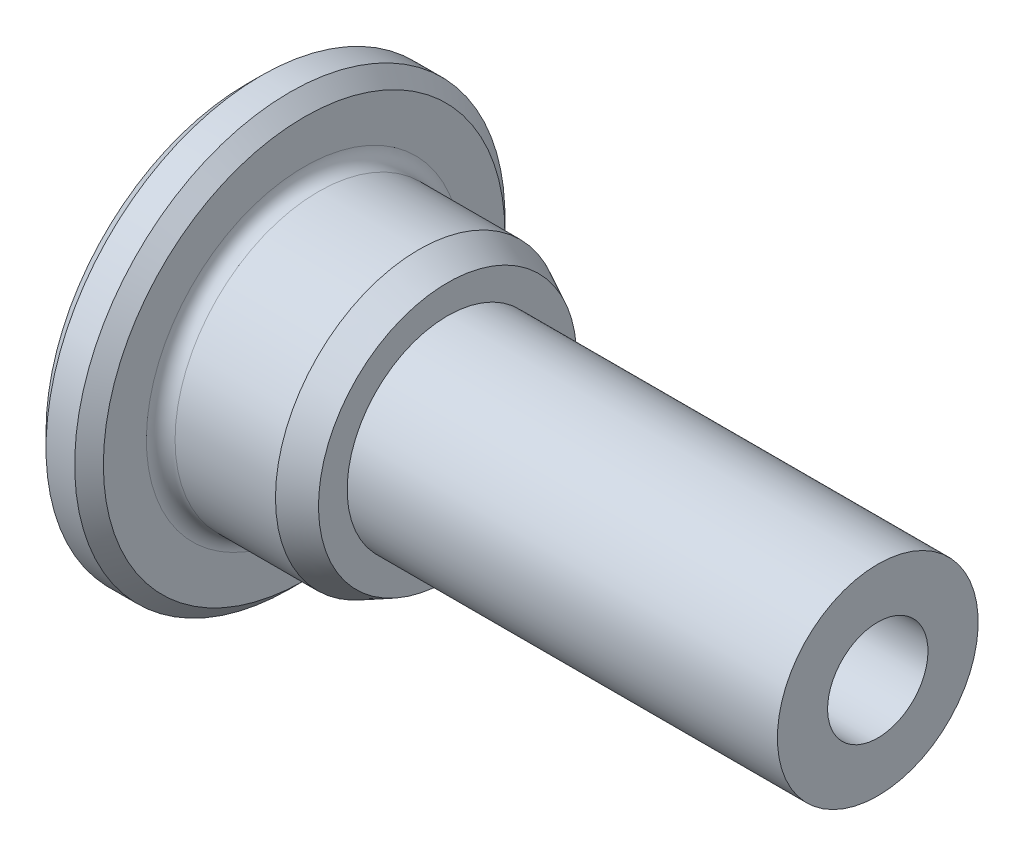
ISO-10303-21;
HEADER;
FILE_DESCRIPTION(('STEP AP214'),'2;1');
FILE_NAME('part.step','',(''),(''),'','','');
FILE_SCHEMA(('AUTOMOTIVE_DESIGN { 1 0 10303 214 1 1 1 1 }'));
ENDSEC;
DATA;
#1=APPLICATION_CONTEXT('core data for automotive mechanical design processes');
#2=APPLICATION_PROTOCOL_DEFINITION('international standard','automotive_design',2000,#1);
#3=PRODUCT_CONTEXT('',#1,'mechanical');
#4=PRODUCT('Part','Part','',(#3));
#5=PRODUCT_RELATED_PRODUCT_CATEGORY('part','',(#4));
#6=PRODUCT_DEFINITION_FORMATION('','',#4);
#7=PRODUCT_DEFINITION_CONTEXT('part definition',#1,'design');
#8=PRODUCT_DEFINITION('design','',#6,#7);
#9=PRODUCT_DEFINITION_SHAPE('','',#8);
#10=(LENGTH_UNIT() NAMED_UNIT(*) SI_UNIT(.MILLI.,.METRE.));
#11=(NAMED_UNIT(*) PLANE_ANGLE_UNIT() SI_UNIT($,.RADIAN.));
#12=(NAMED_UNIT(*) SI_UNIT($,.STERADIAN.) SOLID_ANGLE_UNIT());
#13=UNCERTAINTY_MEASURE_WITH_UNIT(LENGTH_MEASURE(1.E-05),#10,'distance_accuracy_value','');
#14=(GEOMETRIC_REPRESENTATION_CONTEXT(3) GLOBAL_UNCERTAINTY_ASSIGNED_CONTEXT((#13)) GLOBAL_UNIT_ASSIGNED_CONTEXT((#10,
#11,#12)) REPRESENTATION_CONTEXT('',''));
#15=CARTESIAN_POINT('',(0.,0.,0.));
#16=DIRECTION('',(0.,0.,1.));
#17=DIRECTION('',(1.,0.,0.));
#18=AXIS2_PLACEMENT_3D('',#15,#16,#17);
#19=CARTESIAN_POINT('',(0.,0.,0.));
#20=DIRECTION('',(1.,0.,0.));
#21=DIRECTION('',(0.,1.,0.));
#22=AXIS2_PLACEMENT_3D('',#19,#20,#21);
#23=PLANE('',#22);
#24=CARTESIAN_POINT('',(0.,0.,0.));
#25=DIRECTION('',(1.,0.,0.));
#26=DIRECTION('',(0.,1.,0.));
#27=AXIS2_PLACEMENT_3D('',#24,#25,#26);
#28=CIRCLE('',#27,2.75);
#29=CARTESIAN_POINT('',(0.,2.75,0.));
#30=VERTEX_POINT('',#29);
#31=EDGE_CURVE('E35',#30,#30,#28,.T.);
#32=ORIENTED_EDGE('',*,*,#31,.T.);
#33=EDGE_LOOP('',(#32));
#34=FACE_BOUND('',#33,.T.);
#35=CARTESIAN_POINT('',(0.,0.,0.));
#36=DIRECTION('',(1.,0.,0.));
#37=DIRECTION('',(0.,1.,0.));
#38=AXIS2_PLACEMENT_3D('',#35,#36,#37);
#39=CIRCLE('',#38,6.99999999999999);
#40=CARTESIAN_POINT('',(0.,6.99999999999999,0.));
#41=VERTEX_POINT('',#40);
#42=EDGE_CURVE('E51',#41,#41,#39,.F.);
#43=ORIENTED_EDGE('',*,*,#42,.T.);
#44=EDGE_LOOP('',(#43));
#45=FACE_BOUND('',#44,.T.);
#46=ADVANCED_FACE('F28',(#34,#45),#23,.F.);
#47=CARTESIAN_POINT('',(0.,0.,0.));
#48=DIRECTION('',(-1.,0.,0.));
#49=DIRECTION('',(0.,-1.,0.));
#50=AXIS2_PLACEMENT_3D('',#47,#48,#49);
#51=CYLINDRICAL_SURFACE('',#50,7.49999999999999);
#52=CARTESIAN_POINT('',(0.500000000000004,0.,0.));
#53=DIRECTION('',(1.,0.,0.));
#54=DIRECTION('',(0.,1.,0.));
#55=AXIS2_PLACEMENT_3D('',#52,#53,#54);
#56=CIRCLE('',#55,7.49999999999999);
#57=CARTESIAN_POINT('',(0.500000000000005,7.49999999999999,0.));
#58=VERTEX_POINT('',#57);
#59=EDGE_CURVE('E43',#58,#58,#56,.T.);
#60=ORIENTED_EDGE('',*,*,#59,.T.);
#61=EDGE_LOOP('',(#60));
#62=FACE_BOUND('',#61,.T.);
#63=CARTESIAN_POINT('',(1.50000000000001,0.,0.));
#64=DIRECTION('',(-1.,0.,0.));
#65=DIRECTION('',(0.,-1.,0.));
#66=AXIS2_PLACEMENT_3D('',#63,#64,#65);
#67=CIRCLE('',#66,7.49999999999999);
#68=CARTESIAN_POINT('',(1.5,-7.49999999999999,0.));
#69=VERTEX_POINT('',#68);
#70=EDGE_CURVE('E48',#69,#69,#67,.T.);
#71=ORIENTED_EDGE('',*,*,#70,.T.);
#72=EDGE_LOOP('',(#71));
#73=FACE_BOUND('',#72,.T.);
#74=ADVANCED_FACE('F98',(#62,#73),#51,.T.);
#75=CARTESIAN_POINT('',(2.,7.49999999999999,0.));
#76=DIRECTION('',(-1.,0.,0.));
#77=DIRECTION('',(0.,-1.,0.));
#78=AXIS2_PLACEMENT_3D('',#75,#76,#77);
#79=PLANE('',#78);
#80=CARTESIAN_POINT('',(2.,0.,0.));
#81=DIRECTION('',(-1.,0.,0.));
#82=DIRECTION('',(0.,-1.,0.));
#83=AXIS2_PLACEMENT_3D('',#80,#81,#82);
#84=CIRCLE('',#83,7.);
#85=CARTESIAN_POINT('',(2.,-7.,0.));
#86=VERTEX_POINT('',#85);
#87=EDGE_CURVE('E39',#86,#86,#84,.F.);
#88=ORIENTED_EDGE('',*,*,#87,.T.);
#89=EDGE_LOOP('',(#88));
#90=FACE_BOUND('',#89,.T.);
#91=CARTESIAN_POINT('',(2.,0.,0.));
#92=DIRECTION('',(-1.,0.,0.));
#93=DIRECTION('',(0.,-1.,0.));
#94=AXIS2_PLACEMENT_3D('',#91,#92,#93);
#95=CIRCLE('',#94,5.5);
#96=CARTESIAN_POINT('',(2.,-5.5,0.));
#97=VERTEX_POINT('',#96);
#98=EDGE_CURVE('E57',#97,#97,#95,.T.);
#99=ORIENTED_EDGE('',*,*,#98,.T.);
#100=EDGE_LOOP('',(#99));
#101=FACE_BOUND('',#100,.T.);
#102=ADVANCED_FACE('F103',(#90,#101),#79,.F.);
#103=CARTESIAN_POINT('',(0.,0.,0.));
#104=DIRECTION('',(-1.,0.,0.));
#105=DIRECTION('',(0.,-1.,0.));
#106=AXIS2_PLACEMENT_3D('',#103,#104,#105);
#107=CYLINDRICAL_SURFACE('',#106,5.);
#108=CARTESIAN_POINT('',(2.5,0.,0.));
#109=DIRECTION('',(-1.,0.,0.));
#110=DIRECTION('',(0.,-1.,0.));
#111=AXIS2_PLACEMENT_3D('',#108,#109,#110);
#112=CIRCLE('',#111,5.);
#113=CARTESIAN_POINT('',(2.5,-5.,0.));
#114=VERTEX_POINT('',#113);
#115=EDGE_CURVE('E54',#114,#114,#112,.F.);
#116=ORIENTED_EDGE('',*,*,#115,.T.);
#117=EDGE_LOOP('',(#116));
#118=FACE_BOUND('',#117,.T.);
#119=CARTESIAN_POINT('',(6.,0.,0.));
#120=DIRECTION('',(-1.,0.,0.));
#121=DIRECTION('',(0.,-1.,0.));
#122=AXIS2_PLACEMENT_3D('',#119,#120,#121);
#123=CIRCLE('',#122,5.);
#124=CARTESIAN_POINT('',(6.,-5.,0.));
#125=VERTEX_POINT('',#124);
#126=EDGE_CURVE('E60',#125,#125,#123,.T.);
#127=ORIENTED_EDGE('',*,*,#126,.T.);
#128=EDGE_LOOP('',(#127));
#129=FACE_BOUND('',#128,.T.);
#130=ADVANCED_FACE('F129',(#118,#129),#107,.T.);
#131=CARTESIAN_POINT('',(7.,0.,0.));
#132=DIRECTION('',(-1.,0.,0.));
#133=DIRECTION('',(0.,-1.,0.));
#134=AXIS2_PLACEMENT_3D('',#131,#132,#133);
#135=CONICAL_SURFACE('',#134,4.5,0.463647609000806);
#136=ORIENTED_EDGE('',*,*,#126,.F.);
#137=EDGE_LOOP('',(#136));
#138=FACE_BOUND('',#137,.T.);
#139=CARTESIAN_POINT('',(7.,0.,0.));
#140=DIRECTION('',(-1.,0.,0.));
#141=DIRECTION('',(0.,-1.,0.));
#142=AXIS2_PLACEMENT_3D('',#139,#140,#141);
#143=CIRCLE('',#142,4.5);
#144=CARTESIAN_POINT('',(7.,-4.5,0.));
#145=VERTEX_POINT('',#144);
#146=EDGE_CURVE('E63',#145,#145,#143,.T.);
#147=ORIENTED_EDGE('',*,*,#146,.T.);
#148=EDGE_LOOP('',(#147));
#149=FACE_BOUND('',#148,.T.);
#150=ADVANCED_FACE('F93',(#138,#149),#135,.T.);
#151=CARTESIAN_POINT('',(7.,4.5,0.));
#152=DIRECTION('',(-1.,0.,0.));
#153=DIRECTION('',(0.,-1.,0.));
#154=AXIS2_PLACEMENT_3D('',#151,#152,#153);
#155=PLANE('',#154);
#156=ORIENTED_EDGE('',*,*,#146,.F.);
#157=EDGE_LOOP('',(#156));
#158=FACE_BOUND('',#157,.T.);
#159=CARTESIAN_POINT('',(7.,0.,0.));
#160=DIRECTION('',(-1.,0.,0.));
#161=DIRECTION('',(0.,-1.,0.));
#162=AXIS2_PLACEMENT_3D('',#159,#160,#161);
#163=CIRCLE('',#162,3.5);
#164=CARTESIAN_POINT('',(7.,-3.5,0.));
#165=VERTEX_POINT('',#164);
#166=EDGE_CURVE('E66',#165,#165,#163,.T.);
#167=ORIENTED_EDGE('',*,*,#166,.T.);
#168=EDGE_LOOP('',(#167));
#169=FACE_BOUND('',#168,.T.);
#170=ADVANCED_FACE('F87',(#158,#169),#155,.F.);
#171=CARTESIAN_POINT('',(0.,0.,0.));
#172=DIRECTION('',(-1.,0.,0.));
#173=DIRECTION('',(0.,-1.,0.));
#174=AXIS2_PLACEMENT_3D('',#171,#172,#173);
#175=CYLINDRICAL_SURFACE('',#174,3.5);
#176=ORIENTED_EDGE('',*,*,#166,.F.);
#177=EDGE_LOOP('',(#176));
#178=FACE_BOUND('',#177,.T.);
#179=CARTESIAN_POINT('',(22.,0.,0.));
#180=DIRECTION('',(-1.,0.,0.));
#181=DIRECTION('',(0.,-1.,0.));
#182=AXIS2_PLACEMENT_3D('',#179,#180,#181);
#183=CIRCLE('',#182,3.5);
#184=CARTESIAN_POINT('',(22.,-3.5,0.));
#185=VERTEX_POINT('',#184);
#186=EDGE_CURVE('E69',#185,#185,#183,.T.);
#187=ORIENTED_EDGE('',*,*,#186,.T.);
#188=EDGE_LOOP('',(#187));
#189=FACE_BOUND('',#188,.T.);
#190=ADVANCED_FACE('F82',(#178,#189),#175,.T.);
#191=CARTESIAN_POINT('',(22.,3.5,0.));
#192=DIRECTION('',(-1.,0.,0.));
#193=DIRECTION('',(0.,-1.,0.));
#194=AXIS2_PLACEMENT_3D('',#191,#192,#193);
#195=PLANE('',#194);
#196=CARTESIAN_POINT('',(22.,0.,0.));
#197=DIRECTION('',(1.,0.,0.));
#198=DIRECTION('',(0.,1.,0.));
#199=AXIS2_PLACEMENT_3D('',#196,#197,#198);
#200=CIRCLE('',#199,1.75);
#201=CARTESIAN_POINT('',(22.,1.75,0.));
#202=VERTEX_POINT('',#201);
#203=EDGE_CURVE('E72',#202,#202,#200,.T.);
#204=ORIENTED_EDGE('',*,*,#203,.F.);
#205=EDGE_LOOP('',(#204));
#206=FACE_BOUND('',#205,.T.);
#207=ORIENTED_EDGE('',*,*,#186,.F.);
#208=EDGE_LOOP('',(#207));
#209=FACE_BOUND('',#208,.T.);
#210=ADVANCED_FACE('F78',(#206,#209),#195,.F.);
#211=CARTESIAN_POINT('',(2.5,0.,0.));
#212=DIRECTION('',(-1.,0.,0.));
#213=DIRECTION('',(0.,-1.,0.));
#214=AXIS2_PLACEMENT_3D('',#211,#212,#213);
#215=TOROIDAL_SURFACE('',#214,5.5,0.5);
#216=ORIENTED_EDGE('',*,*,#115,.F.);
#217=EDGE_LOOP('',(#216));
#218=FACE_BOUND('',#217,.T.);
#219=ORIENTED_EDGE('',*,*,#98,.F.);
#220=EDGE_LOOP('',(#219));
#221=FACE_BOUND('',#220,.T.);
#222=ADVANCED_FACE('F81',(#218,#221),#215,.F.);
#223=CARTESIAN_POINT('',(0.,0.,0.));
#224=DIRECTION('',(1.,0.,0.));
#225=DIRECTION('',(0.,1.,0.));
#226=AXIS2_PLACEMENT_3D('',#223,#224,#225);
#227=CONICAL_SURFACE('',#226,6.99999999999999,0.785398163397447);
#228=ORIENTED_EDGE('',*,*,#59,.F.);
#229=EDGE_LOOP('',(#228));
#230=FACE_BOUND('',#229,.T.);
#231=ORIENTED_EDGE('',*,*,#42,.F.);
#232=EDGE_LOOP('',(#231));
#233=FACE_BOUND('',#232,.T.);
#234=ADVANCED_FACE('F111',(#230,#233),#227,.T.);
#235=CARTESIAN_POINT('',(1.50000000000001,0.,0.));
#236=DIRECTION('',(-1.,0.,0.));
#237=DIRECTION('',(0.,-1.,0.));
#238=AXIS2_PLACEMENT_3D('',#235,#236,#237);
#239=CONICAL_SURFACE('',#238,7.49999999999999,0.785398163397448);
#240=ORIENTED_EDGE('',*,*,#87,.F.);
#241=EDGE_LOOP('',(#240));
#242=FACE_BOUND('',#241,.T.);
#243=ORIENTED_EDGE('',*,*,#70,.F.);
#244=EDGE_LOOP('',(#243));
#245=FACE_BOUND('',#244,.T.);
#246=ADVANCED_FACE('F114',(#242,#245),#239,.T.);
#247=CARTESIAN_POINT('',(0.,0.,0.));
#248=DIRECTION('',(1.,0.,0.));
#249=DIRECTION('',(0.,1.,0.));
#250=AXIS2_PLACEMENT_3D('',#247,#248,#249);
#251=CYLINDRICAL_SURFACE('',#250,1.75);
#252=CARTESIAN_POINT('',(1.00000000000001,0.,0.));
#253=DIRECTION('',(1.,0.,0.));
#254=DIRECTION('',(0.,1.,0.));
#255=AXIS2_PLACEMENT_3D('',#252,#253,#254);
#256=CIRCLE('',#255,1.75);
#257=CARTESIAN_POINT('',(1.00000000000001,1.75,0.));
#258=VERTEX_POINT('',#257);
#259=EDGE_CURVE('E10',#258,#258,#256,.F.);
#260=ORIENTED_EDGE('',*,*,#259,.T.);
#261=EDGE_LOOP('',(#260));
#262=FACE_BOUND('',#261,.T.);
#263=ORIENTED_EDGE('',*,*,#203,.T.);
#264=EDGE_LOOP('',(#263));
#265=FACE_BOUND('',#264,.T.);
#266=ADVANCED_FACE('F76',(#262,#265),#251,.F.);
#267=CARTESIAN_POINT('',(0.,0.,0.));
#268=DIRECTION('',(-1.,0.,0.));
#269=DIRECTION('',(0.,-1.,0.));
#270=AXIS2_PLACEMENT_3D('',#267,#268,#269);
#271=CONICAL_SURFACE('',#270,2.75,0.785398163397446);
#272=ORIENTED_EDGE('',*,*,#259,.F.);
#273=EDGE_LOOP('',(#272));
#274=FACE_BOUND('',#273,.T.);
#275=ORIENTED_EDGE('',*,*,#31,.F.);
#276=EDGE_LOOP('',(#275));
#277=FACE_BOUND('',#276,.T.);
#278=ADVANCED_FACE('F30',(#274,#277),#271,.F.);
#279=CLOSED_SHELL('',(#46,#74,#102,#130,#150,#170,#190,#210,#222,#234,#246,#266,#278));
#280=MANIFOLD_SOLID_BREP('B2',#279);
#281=ADVANCED_BREP_SHAPE_REPRESENTATION('',(#18,#280),#14);
#282=SHAPE_DEFINITION_REPRESENTATION(#9,#281);
ENDSEC;
END-ISO-10303-21;
